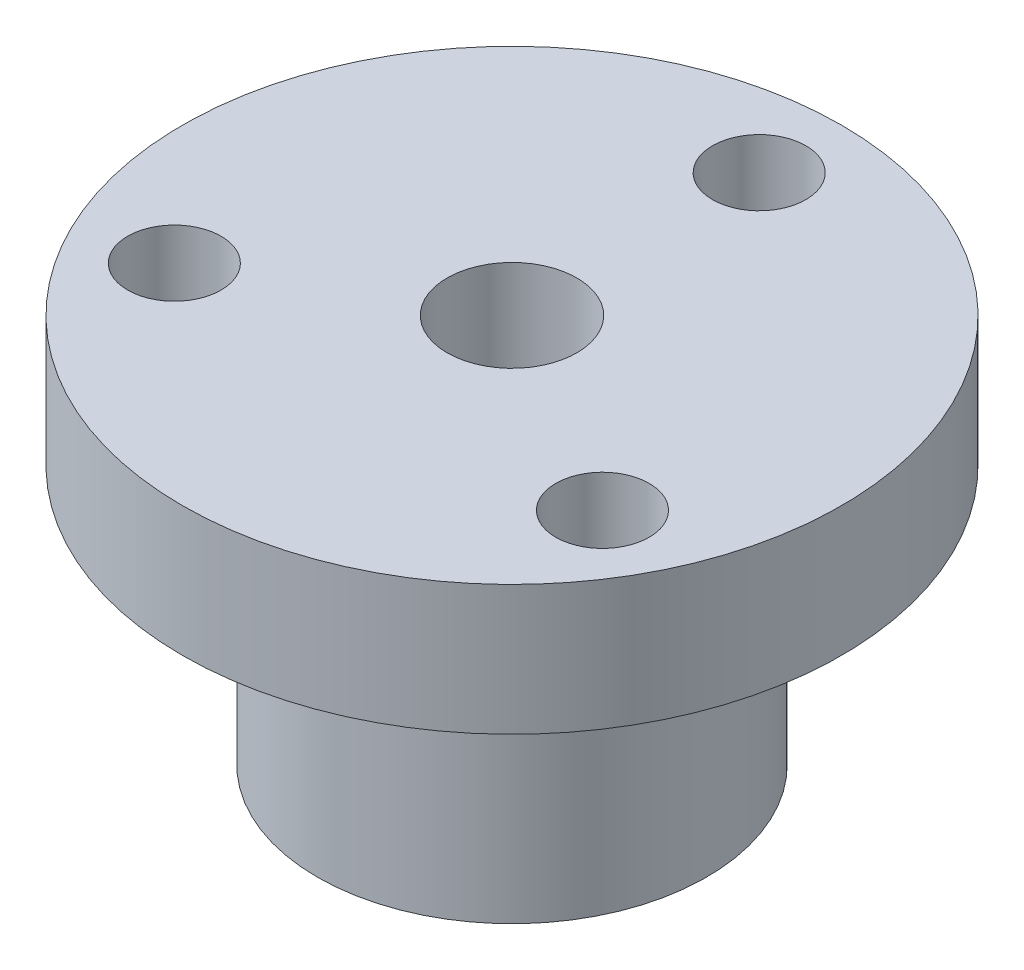
ISO-10303-21;
HEADER;
FILE_DESCRIPTION(('STEP AP214'),'2;1');
FILE_NAME('part.step','',(''),(''),'','','');
FILE_SCHEMA(('AUTOMOTIVE_DESIGN { 1 0 10303 214 1 1 1 1 }'));
ENDSEC;
DATA;
#1=APPLICATION_CONTEXT('core data for automotive mechanical design processes');
#2=APPLICATION_PROTOCOL_DEFINITION('international standard','automotive_design',2000,#1);
#3=PRODUCT_CONTEXT('',#1,'mechanical');
#4=PRODUCT('Part','Part','',(#3));
#5=PRODUCT_RELATED_PRODUCT_CATEGORY('part','',(#4));
#6=PRODUCT_DEFINITION_FORMATION('','',#4);
#7=PRODUCT_DEFINITION_CONTEXT('part definition',#1,'design');
#8=PRODUCT_DEFINITION('design','',#6,#7);
#9=PRODUCT_DEFINITION_SHAPE('','',#8);
#10=(LENGTH_UNIT() NAMED_UNIT(*) SI_UNIT(.MILLI.,.METRE.));
#11=(NAMED_UNIT(*) PLANE_ANGLE_UNIT() SI_UNIT($,.RADIAN.));
#12=(NAMED_UNIT(*) SI_UNIT($,.STERADIAN.) SOLID_ANGLE_UNIT());
#13=UNCERTAINTY_MEASURE_WITH_UNIT(LENGTH_MEASURE(1.E-05),#10,'distance_accuracy_value','');
#14=(GEOMETRIC_REPRESENTATION_CONTEXT(3) GLOBAL_UNCERTAINTY_ASSIGNED_CONTEXT((#13)) GLOBAL_UNIT_ASSIGNED_CONTEXT((#10,
#11,#12)) REPRESENTATION_CONTEXT('',''));
#15=CARTESIAN_POINT('',(0.,0.,0.));
#16=DIRECTION('',(0.,0.,1.));
#17=DIRECTION('',(1.,0.,0.));
#18=AXIS2_PLACEMENT_3D('',#15,#16,#17);
#19=CARTESIAN_POINT('',(0.,0.,0.));
#20=DIRECTION('',(0.,1.,0.));
#21=DIRECTION('',(0.,0.,1.));
#22=AXIS2_PLACEMENT_3D('',#19,#20,#21);
#23=PLANE('',#22);
#24=CARTESIAN_POINT('',(0.,0.,0.));
#25=DIRECTION('',(0.,1.,0.));
#26=DIRECTION('',(0.,0.,1.));
#27=AXIS2_PLACEMENT_3D('',#24,#25,#26);
#28=CIRCLE('',#27,7.5);
#29=CARTESIAN_POINT('',(0.,0.,7.5));
#30=VERTEX_POINT('',#29);
#31=EDGE_CURVE('E32',#30,#30,#28,.T.);
#32=ORIENTED_EDGE('',*,*,#31,.F.);
#33=EDGE_LOOP('',(#32));
#34=FACE_BOUND('',#33,.T.);
#35=CARTESIAN_POINT('',(0.,0.,0.));
#36=DIRECTION('',(0.,1.,0.));
#37=DIRECTION('',(0.,0.,1.));
#38=AXIS2_PLACEMENT_3D('',#35,#36,#37);
#39=CIRCLE('',#38,2.5);
#40=CARTESIAN_POINT('',(0.,0.,2.5));
#41=VERTEX_POINT('',#40);
#42=EDGE_CURVE('E39',#41,#41,#39,.T.);
#43=ORIENTED_EDGE('',*,*,#42,.T.);
#44=EDGE_LOOP('',(#43));
#45=FACE_BOUND('',#44,.T.);
#46=ADVANCED_FACE('F28',(#34,#45),#23,.F.);
#47=CARTESIAN_POINT('',(0.,10.,0.));
#48=DIRECTION('',(0.,-1.,0.));
#49=DIRECTION('',(0.,0.,-1.));
#50=AXIS2_PLACEMENT_3D('',#47,#48,#49);
#51=CYLINDRICAL_SURFACE('',#50,7.5);
#52=CARTESIAN_POINT('',(0.,10.,0.));
#53=DIRECTION('',(0.,1.,0.));
#54=DIRECTION('',(0.,0.,1.));
#55=AXIS2_PLACEMENT_3D('',#52,#53,#54);
#56=CIRCLE('',#55,7.5);
#57=CARTESIAN_POINT('',(0.,10.,7.5));
#58=VERTEX_POINT('',#57);
#59=EDGE_CURVE('E10',#58,#58,#56,.T.);
#60=ORIENTED_EDGE('',*,*,#59,.F.);
#61=EDGE_LOOP('',(#60));
#62=FACE_BOUND('',#61,.T.);
#63=ORIENTED_EDGE('',*,*,#31,.T.);
#64=EDGE_LOOP('',(#63));
#65=FACE_BOUND('',#64,.T.);
#66=ADVANCED_FACE('F30',(#62,#65),#51,.T.);
#67=CARTESIAN_POINT('',(0.,10.,0.));
#68=DIRECTION('',(0.,-1.,0.));
#69=DIRECTION('',(0.,0.,-1.));
#70=AXIS2_PLACEMENT_3D('',#67,#68,#69);
#71=CYLINDRICAL_SURFACE('',#70,2.5);
#72=ORIENTED_EDGE('',*,*,#42,.F.);
#73=EDGE_LOOP('',(#72));
#74=FACE_BOUND('',#73,.T.);
#75=CARTESIAN_POINT('',(0.,15.,0.));
#76=DIRECTION('',(0.,1.,0.));
#77=DIRECTION('',(0.,0.,1.));
#78=AXIS2_PLACEMENT_3D('',#75,#76,#77);
#79=CIRCLE('',#78,2.5);
#80=CARTESIAN_POINT('',(0.,15.,2.5));
#81=VERTEX_POINT('',#80);
#82=EDGE_CURVE('E47',#81,#81,#79,.T.);
#83=ORIENTED_EDGE('',*,*,#82,.T.);
#84=EDGE_LOOP('',(#83));
#85=FACE_BOUND('',#84,.T.);
#86=ADVANCED_FACE('F88',(#74,#85),#71,.F.);
#87=CARTESIAN_POINT('',(0.,10.,0.));
#88=DIRECTION('',(0.,1.,0.));
#89=DIRECTION('',(0.,0.,1.));
#90=AXIS2_PLACEMENT_3D('',#87,#88,#89);
#91=PLANE('',#90);
#92=CARTESIAN_POINT('',(8.24889197104676,10.,4.76250000000004));
#93=DIRECTION('',(0.,1.,0.));
#94=DIRECTION('',(0.,0.,1.));
#95=AXIS2_PLACEMENT_3D('',#92,#93,#94);
#96=CIRCLE('',#95,1.8);
#97=CARTESIAN_POINT('',(8.24889197104676,10.,6.56250000000004));
#98=VERTEX_POINT('',#97);
#99=EDGE_CURVE('E64',#98,#98,#96,.T.);
#100=ORIENTED_EDGE('',*,*,#99,.T.);
#101=EDGE_LOOP('',(#100));
#102=FACE_BOUND('',#101,.T.);
#103=CARTESIAN_POINT('',(-8.24889197104682,10.,4.76249999999992));
#104=DIRECTION('',(0.,1.,0.));
#105=DIRECTION('',(0.,0.,1.));
#106=AXIS2_PLACEMENT_3D('',#103,#104,#105);
#107=CIRCLE('',#106,1.8);
#108=CARTESIAN_POINT('',(-8.24889197104682,10.,6.56249999999992));
#109=VERTEX_POINT('',#108);
#110=EDGE_CURVE('E58',#109,#109,#107,.T.);
#111=ORIENTED_EDGE('',*,*,#110,.T.);
#112=EDGE_LOOP('',(#111));
#113=FACE_BOUND('',#112,.T.);
#114=CARTESIAN_POINT('',(0.,10.,-9.525));
#115=DIRECTION('',(0.,1.,0.));
#116=DIRECTION('',(0.,0.,1.));
#117=AXIS2_PLACEMENT_3D('',#114,#115,#116);
#118=CIRCLE('',#117,1.8);
#119=CARTESIAN_POINT('',(0.,10.,-7.725));
#120=VERTEX_POINT('',#119);
#121=EDGE_CURVE('E52',#120,#120,#118,.T.);
#122=ORIENTED_EDGE('',*,*,#121,.T.);
#123=EDGE_LOOP('',(#122));
#124=FACE_BOUND('',#123,.T.);
#125=CARTESIAN_POINT('',(0.,10.,0.));
#126=DIRECTION('',(0.,1.,0.));
#127=DIRECTION('',(0.,0.,1.));
#128=AXIS2_PLACEMENT_3D('',#125,#126,#127);
#129=CIRCLE('',#128,12.7);
#130=CARTESIAN_POINT('',(0.,10.,12.7));
#131=VERTEX_POINT('',#130);
#132=EDGE_CURVE('E44',#131,#131,#129,.T.);
#133=ORIENTED_EDGE('',*,*,#132,.F.);
#134=EDGE_LOOP('',(#133));
#135=FACE_BOUND('',#134,.T.);
#136=ORIENTED_EDGE('',*,*,#59,.T.);
#137=EDGE_LOOP('',(#136));
#138=FACE_BOUND('',#137,.T.);
#139=ADVANCED_FACE('F78',(#102,#113,#124,#135,#138),#91,.F.);
#140=CARTESIAN_POINT('',(0.,15.,0.));
#141=DIRECTION('',(0.,1.,0.));
#142=DIRECTION('',(0.,0.,1.));
#143=AXIS2_PLACEMENT_3D('',#140,#141,#142);
#144=PLANE('',#143);
#145=CARTESIAN_POINT('',(8.24889197104676,15.,4.76250000000004));
#146=DIRECTION('',(0.,1.,0.));
#147=DIRECTION('',(0.,0.,1.));
#148=AXIS2_PLACEMENT_3D('',#145,#146,#147);
#149=CIRCLE('',#148,1.8);
#150=CARTESIAN_POINT('',(8.24889197104676,15.,6.56250000000004));
#151=VERTEX_POINT('',#150);
#152=EDGE_CURVE('E67',#151,#151,#149,.T.);
#153=ORIENTED_EDGE('',*,*,#152,.F.);
#154=EDGE_LOOP('',(#153));
#155=FACE_BOUND('',#154,.T.);
#156=CARTESIAN_POINT('',(-8.24889197104682,15.,4.76249999999992));
#157=DIRECTION('',(0.,1.,0.));
#158=DIRECTION('',(0.,0.,1.));
#159=AXIS2_PLACEMENT_3D('',#156,#157,#158);
#160=CIRCLE('',#159,1.8);
#161=CARTESIAN_POINT('',(-8.24889197104682,15.,6.56249999999992));
#162=VERTEX_POINT('',#161);
#163=EDGE_CURVE('E61',#162,#162,#160,.T.);
#164=ORIENTED_EDGE('',*,*,#163,.F.);
#165=EDGE_LOOP('',(#164));
#166=FACE_BOUND('',#165,.T.);
#167=CARTESIAN_POINT('',(0.,15.,-9.525));
#168=DIRECTION('',(0.,1.,0.));
#169=DIRECTION('',(0.,0.,1.));
#170=AXIS2_PLACEMENT_3D('',#167,#168,#169);
#171=CIRCLE('',#170,1.8);
#172=CARTESIAN_POINT('',(0.,15.,-7.725));
#173=VERTEX_POINT('',#172);
#174=EDGE_CURVE('E55',#173,#173,#171,.T.);
#175=ORIENTED_EDGE('',*,*,#174,.F.);
#176=EDGE_LOOP('',(#175));
#177=FACE_BOUND('',#176,.T.);
#178=CARTESIAN_POINT('',(0.,15.,0.));
#179=DIRECTION('',(0.,1.,0.));
#180=DIRECTION('',(0.,0.,1.));
#181=AXIS2_PLACEMENT_3D('',#178,#179,#180);
#182=CIRCLE('',#181,12.7);
#183=CARTESIAN_POINT('',(0.,15.,12.7));
#184=VERTEX_POINT('',#183);
#185=EDGE_CURVE('E43',#184,#184,#182,.T.);
#186=ORIENTED_EDGE('',*,*,#185,.T.);
#187=EDGE_LOOP('',(#186));
#188=FACE_BOUND('',#187,.T.);
#189=ORIENTED_EDGE('',*,*,#82,.F.);
#190=EDGE_LOOP('',(#189));
#191=FACE_BOUND('',#190,.T.);
#192=ADVANCED_FACE('F74',(#155,#166,#177,#188,#191),#144,.T.);
#193=CARTESIAN_POINT('',(0.,15.,0.));
#194=DIRECTION('',(0.,-1.,0.));
#195=DIRECTION('',(0.,0.,-1.));
#196=AXIS2_PLACEMENT_3D('',#193,#194,#195);
#197=CYLINDRICAL_SURFACE('',#196,12.7);
#198=ORIENTED_EDGE('',*,*,#185,.F.);
#199=EDGE_LOOP('',(#198));
#200=FACE_BOUND('',#199,.T.);
#201=ORIENTED_EDGE('',*,*,#132,.T.);
#202=EDGE_LOOP('',(#201));
#203=FACE_BOUND('',#202,.T.);
#204=ADVANCED_FACE('F77',(#200,#203),#197,.T.);
#205=CARTESIAN_POINT('',(0.,0.,-9.525));
#206=DIRECTION('',(0.,1.,0.));
#207=DIRECTION('',(0.,0.,1.));
#208=AXIS2_PLACEMENT_3D('',#205,#206,#207);
#209=CYLINDRICAL_SURFACE('',#208,1.8);
#210=ORIENTED_EDGE('',*,*,#174,.T.);
#211=EDGE_LOOP('',(#210));
#212=FACE_BOUND('',#211,.T.);
#213=ORIENTED_EDGE('',*,*,#121,.F.);
#214=EDGE_LOOP('',(#213));
#215=FACE_BOUND('',#214,.T.);
#216=ADVANCED_FACE('F127',(#212,#215),#209,.F.);
#217=CARTESIAN_POINT('',(-8.24889197104682,0.,4.76249999999992));
#218=DIRECTION('',(0.,1.,0.));
#219=DIRECTION('',(0.,0.,1.));
#220=AXIS2_PLACEMENT_3D('',#217,#218,#219);
#221=CYLINDRICAL_SURFACE('',#220,1.8);
#222=ORIENTED_EDGE('',*,*,#163,.T.);
#223=EDGE_LOOP('',(#222));
#224=FACE_BOUND('',#223,.T.);
#225=ORIENTED_EDGE('',*,*,#110,.F.);
#226=EDGE_LOOP('',(#225));
#227=FACE_BOUND('',#226,.T.);
#228=ADVANCED_FACE('F147',(#224,#227),#221,.F.);
#229=CARTESIAN_POINT('',(8.24889197104676,0.,4.76250000000004));
#230=DIRECTION('',(0.,1.,0.));
#231=DIRECTION('',(0.,0.,1.));
#232=AXIS2_PLACEMENT_3D('',#229,#230,#231);
#233=CYLINDRICAL_SURFACE('',#232,1.8);
#234=ORIENTED_EDGE('',*,*,#152,.T.);
#235=EDGE_LOOP('',(#234));
#236=FACE_BOUND('',#235,.T.);
#237=ORIENTED_EDGE('',*,*,#99,.F.);
#238=EDGE_LOOP('',(#237));
#239=FACE_BOUND('',#238,.T.);
#240=ADVANCED_FACE('F71',(#236,#239),#233,.F.);
#241=CLOSED_SHELL('',(#46,#66,#86,#139,#192,#204,#216,#228,#240));
#242=MANIFOLD_SOLID_BREP('B2',#241);
#243=ADVANCED_BREP_SHAPE_REPRESENTATION('',(#18,#242),#14);
#244=SHAPE_DEFINITION_REPRESENTATION(#9,#243);
ENDSEC;
END-ISO-10303-21;
